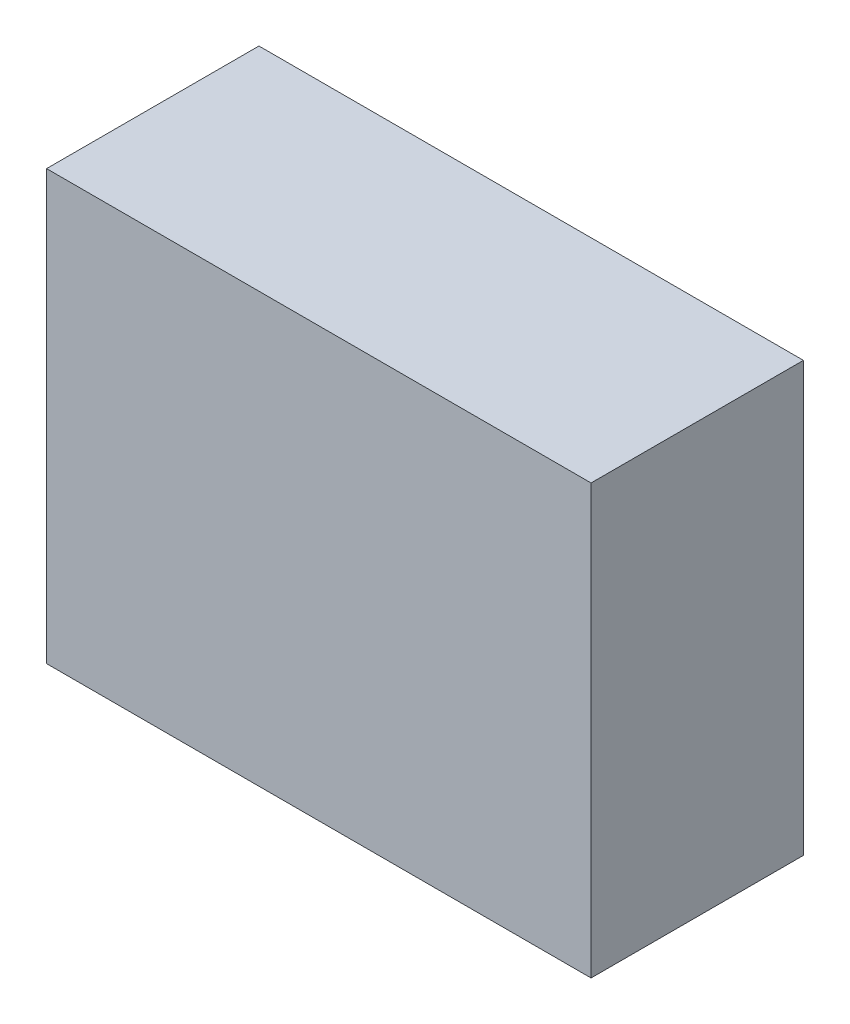
ISO-10303-21;
HEADER;
FILE_DESCRIPTION(('STEP AP214'),'2;1');
FILE_NAME('part.step','',(''),(''),'','','');
FILE_SCHEMA(('AUTOMOTIVE_DESIGN { 1 0 10303 214 1 1 1 1 }'));
ENDSEC;
DATA;
#1=APPLICATION_CONTEXT('core data for automotive mechanical design processes');
#2=APPLICATION_PROTOCOL_DEFINITION('international standard','automotive_design',2000,#1);
#3=PRODUCT_CONTEXT('',#1,'mechanical');
#4=PRODUCT('Part','Part','',(#3));
#5=PRODUCT_RELATED_PRODUCT_CATEGORY('part','',(#4));
#6=PRODUCT_DEFINITION_FORMATION('','',#4);
#7=PRODUCT_DEFINITION_CONTEXT('part definition',#1,'design');
#8=PRODUCT_DEFINITION('design','',#6,#7);
#9=PRODUCT_DEFINITION_SHAPE('','',#8);
#10=(LENGTH_UNIT() NAMED_UNIT(*) SI_UNIT(.MILLI.,.METRE.));
#11=(NAMED_UNIT(*) PLANE_ANGLE_UNIT() SI_UNIT($,.RADIAN.));
#12=(NAMED_UNIT(*) SI_UNIT($,.STERADIAN.) SOLID_ANGLE_UNIT());
#13=UNCERTAINTY_MEASURE_WITH_UNIT(LENGTH_MEASURE(1.E-05),#10,'distance_accuracy_value','');
#14=(GEOMETRIC_REPRESENTATION_CONTEXT(3) GLOBAL_UNCERTAINTY_ASSIGNED_CONTEXT((#13)) GLOBAL_UNIT_ASSIGNED_CONTEXT((#10,
#11,#12)) REPRESENTATION_CONTEXT('',''));
#15=CARTESIAN_POINT('',(0.,0.,0.));
#16=DIRECTION('',(0.,0.,1.));
#17=DIRECTION('',(1.,0.,0.));
#18=AXIS2_PLACEMENT_3D('',#15,#16,#17);
#19=CARTESIAN_POINT('',(15.875,-12.5,12.38256));
#20=DIRECTION('',(-1.,0.,0.));
#21=DIRECTION('',(0.,0.,1.));
#22=AXIS2_PLACEMENT_3D('',#19,#20,#21);
#23=PLANE('',#22);
#24=DIRECTION('',(0.,1.,0.));
#25=VECTOR('',#24,1.);
#26=CARTESIAN_POINT('',(15.875,-12.5,0.));
#27=LINE('',#26,#25);
#28=CARTESIAN_POINT('',(15.875,-12.5,0.));
#29=VERTEX_POINT('',#28);
#30=CARTESIAN_POINT('',(15.875,12.5,0.));
#31=VERTEX_POINT('',#30);
#32=EDGE_CURVE('E96',#29,#31,#27,.T.);
#33=ORIENTED_EDGE('',*,*,#32,.T.);
#34=DIRECTION('',(0.,0.,-1.));
#35=VECTOR('',#34,1.);
#36=CARTESIAN_POINT('',(15.875,12.5,12.38256));
#37=LINE('',#36,#35);
#38=CARTESIAN_POINT('',(15.875,12.5,12.38256));
#39=VERTEX_POINT('',#38);
#40=EDGE_CURVE('E11',#39,#31,#37,.T.);
#41=ORIENTED_EDGE('',*,*,#40,.F.);
#42=DIRECTION('',(0.,1.,0.));
#43=VECTOR('',#42,1.);
#44=CARTESIAN_POINT('',(15.875,-12.5,12.38256));
#45=LINE('',#44,#43);
#46=CARTESIAN_POINT('',(15.875,-12.5,12.38256));
#47=VERTEX_POINT('',#46);
#48=EDGE_CURVE('E84',#47,#39,#45,.T.);
#49=ORIENTED_EDGE('',*,*,#48,.F.);
#50=DIRECTION('',(0.,0.,-1.));
#51=VECTOR('',#50,1.);
#52=CARTESIAN_POINT('',(15.875,-12.5,12.38256));
#53=LINE('',#52,#51);
#54=EDGE_CURVE('E92',#47,#29,#53,.T.);
#55=ORIENTED_EDGE('',*,*,#54,.T.);
#56=EDGE_LOOP('',(#33,#41,#49,#55));
#57=FACE_BOUND('',#56,.T.);
#58=ADVANCED_FACE('F33',(#57),#23,.F.);
#59=CARTESIAN_POINT('',(-15.875,12.5,12.38256));
#60=DIRECTION('',(0.,-1.,0.));
#61=DIRECTION('',(0.,0.,-1.));
#62=AXIS2_PLACEMENT_3D('',#59,#60,#61);
#63=PLANE('',#62);
#64=DIRECTION('',(-1.,0.,0.));
#65=VECTOR('',#64,1.);
#66=CARTESIAN_POINT('',(-15.875,12.5,0.));
#67=LINE('',#66,#65);
#68=CARTESIAN_POINT('',(-15.875,12.5,0.));
#69=VERTEX_POINT('',#68);
#70=EDGE_CURVE('E88',#31,#69,#67,.T.);
#71=ORIENTED_EDGE('',*,*,#70,.T.);
#72=DIRECTION('',(0.,0.,-1.));
#73=VECTOR('',#72,1.);
#74=CARTESIAN_POINT('',(-15.875,12.5,12.38256));
#75=LINE('',#74,#73);
#76=CARTESIAN_POINT('',(-15.875,12.5,12.38256));
#77=VERTEX_POINT('',#76);
#78=EDGE_CURVE('E41',#77,#69,#75,.T.);
#79=ORIENTED_EDGE('',*,*,#78,.F.);
#80=DIRECTION('',(-1.,0.,0.));
#81=VECTOR('',#80,1.);
#82=CARTESIAN_POINT('',(-15.875,12.5,12.38256));
#83=LINE('',#82,#81);
#84=EDGE_CURVE('E79',#39,#77,#83,.T.);
#85=ORIENTED_EDGE('',*,*,#84,.F.);
#86=ORIENTED_EDGE('',*,*,#40,.T.);
#87=EDGE_LOOP('',(#71,#79,#85,#86));
#88=FACE_BOUND('',#87,.T.);
#89=ADVANCED_FACE('F87',(#88),#63,.F.);
#90=CARTESIAN_POINT('',(-15.875,-12.5,12.38256));
#91=DIRECTION('',(1.,0.,0.));
#92=DIRECTION('',(0.,0.,-1.));
#93=AXIS2_PLACEMENT_3D('',#90,#91,#92);
#94=PLANE('',#93);
#95=DIRECTION('',(0.,-1.,0.));
#96=VECTOR('',#95,1.);
#97=CARTESIAN_POINT('',(-15.875,-12.5,0.));
#98=LINE('',#97,#96);
#99=CARTESIAN_POINT('',(-15.875,-12.5,0.));
#100=VERTEX_POINT('',#99);
#101=EDGE_CURVE('E66',#69,#100,#98,.T.);
#102=ORIENTED_EDGE('',*,*,#101,.T.);
#103=DIRECTION('',(0.,0.,-1.));
#104=VECTOR('',#103,1.);
#105=CARTESIAN_POINT('',(-15.875,-12.5,12.38256));
#106=LINE('',#105,#104);
#107=CARTESIAN_POINT('',(-15.875,-12.5,12.38256));
#108=VERTEX_POINT('',#107);
#109=EDGE_CURVE('E89',#108,#100,#106,.T.);
#110=ORIENTED_EDGE('',*,*,#109,.F.);
#111=DIRECTION('',(0.,-1.,0.));
#112=VECTOR('',#111,1.);
#113=CARTESIAN_POINT('',(-15.875,-12.5,12.38256));
#114=LINE('',#113,#112);
#115=EDGE_CURVE('E82',#77,#108,#114,.T.);
#116=ORIENTED_EDGE('',*,*,#115,.F.);
#117=ORIENTED_EDGE('',*,*,#78,.T.);
#118=EDGE_LOOP('',(#102,#110,#116,#117));
#119=FACE_BOUND('',#118,.T.);
#120=ADVANCED_FACE('F90',(#119),#94,.F.);
#121=CARTESIAN_POINT('',(-15.875,-12.5,12.38256));
#122=DIRECTION('',(0.,1.,0.));
#123=DIRECTION('',(0.,0.,1.));
#124=AXIS2_PLACEMENT_3D('',#121,#122,#123);
#125=PLANE('',#124);
#126=DIRECTION('',(1.,0.,0.));
#127=VECTOR('',#126,1.);
#128=CARTESIAN_POINT('',(-15.875,-12.5,0.));
#129=LINE('',#128,#127);
#130=EDGE_CURVE('E72',#100,#29,#129,.T.);
#131=ORIENTED_EDGE('',*,*,#130,.T.);
#132=ORIENTED_EDGE('',*,*,#54,.F.);
#133=DIRECTION('',(1.,0.,0.));
#134=VECTOR('',#133,1.);
#135=CARTESIAN_POINT('',(-15.875,-12.5,12.38256));
#136=LINE('',#135,#134);
#137=EDGE_CURVE('E49',#108,#47,#136,.T.);
#138=ORIENTED_EDGE('',*,*,#137,.F.);
#139=ORIENTED_EDGE('',*,*,#109,.T.);
#140=EDGE_LOOP('',(#131,#132,#138,#139));
#141=FACE_BOUND('',#140,.T.);
#142=ADVANCED_FACE('F103',(#141),#125,.F.);
#143=CARTESIAN_POINT('',(0.,0.,12.38256));
#144=DIRECTION('',(0.,0.,-1.));
#145=DIRECTION('',(-1.,0.,0.));
#146=AXIS2_PLACEMENT_3D('',#143,#144,#145);
#147=PLANE('',#146);
#148=ORIENTED_EDGE('',*,*,#48,.T.);
#149=ORIENTED_EDGE('',*,*,#84,.T.);
#150=ORIENTED_EDGE('',*,*,#115,.T.);
#151=ORIENTED_EDGE('',*,*,#137,.T.);
#152=EDGE_LOOP('',(#148,#149,#150,#151));
#153=FACE_BOUND('',#152,.T.);
#154=ADVANCED_FACE('F80',(#153),#147,.F.);
#155=CARTESIAN_POINT('',(0.,0.,0.));
#156=DIRECTION('',(0.,0.,-1.));
#157=DIRECTION('',(-1.,0.,0.));
#158=AXIS2_PLACEMENT_3D('',#155,#156,#157);
#159=PLANE('',#158);
#160=ORIENTED_EDGE('',*,*,#32,.F.);
#161=ORIENTED_EDGE('',*,*,#130,.F.);
#162=ORIENTED_EDGE('',*,*,#101,.F.);
#163=ORIENTED_EDGE('',*,*,#70,.F.);
#164=EDGE_LOOP('',(#160,#161,#162,#163));
#165=FACE_BOUND('',#164,.T.);
#166=ADVANCED_FACE('F106',(#165),#159,.T.);
#167=CLOSED_SHELL('',(#58,#89,#120,#142,#154,#166));
#168=MANIFOLD_SOLID_BREP('B2',#167);
#169=ADVANCED_BREP_SHAPE_REPRESENTATION('',(#18,#168),#14);
#170=SHAPE_DEFINITION_REPRESENTATION(#9,#169);
ENDSEC;
END-ISO-10303-21;
